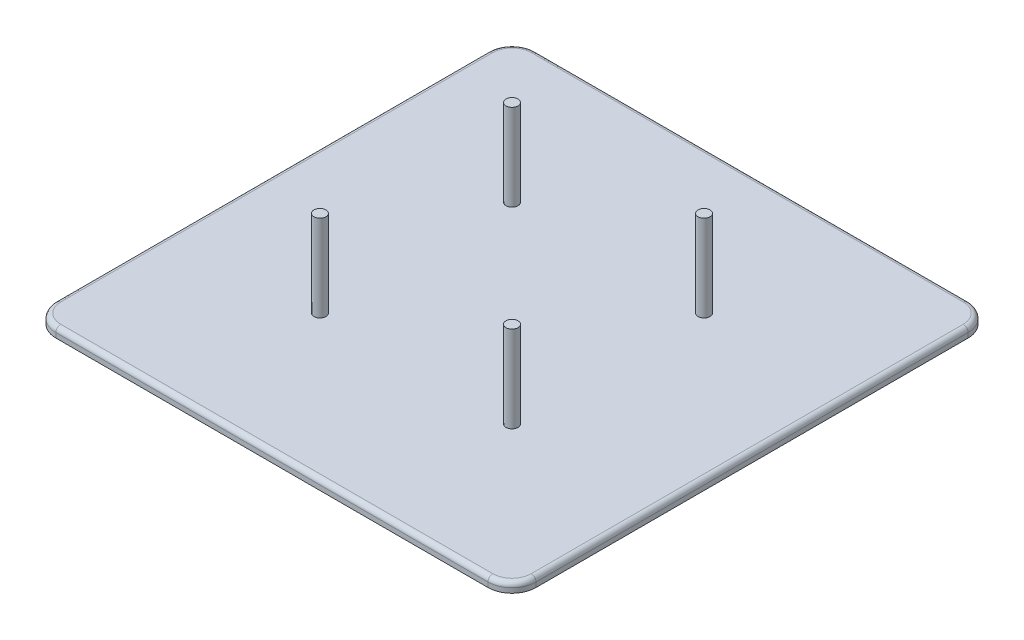
ISO-10303-21;
HEADER;
FILE_DESCRIPTION(('STEP AP214'),'2;1');
FILE_NAME('part.step','',(''),(''),'','','');
FILE_SCHEMA(('AUTOMOTIVE_DESIGN { 1 0 10303 214 1 1 1 1 }'));
ENDSEC;
DATA;
#1=APPLICATION_CONTEXT('core data for automotive mechanical design processes');
#2=APPLICATION_PROTOCOL_DEFINITION('international standard','automotive_design',2000,#1);
#3=PRODUCT_CONTEXT('',#1,'mechanical');
#4=PRODUCT('Part','Part','',(#3));
#5=PRODUCT_RELATED_PRODUCT_CATEGORY('part','',(#4));
#6=PRODUCT_DEFINITION_FORMATION('','',#4);
#7=PRODUCT_DEFINITION_CONTEXT('part definition',#1,'design');
#8=PRODUCT_DEFINITION('design','',#6,#7);
#9=PRODUCT_DEFINITION_SHAPE('','',#8);
#10=(LENGTH_UNIT() NAMED_UNIT(*) SI_UNIT(.MILLI.,.METRE.));
#11=(NAMED_UNIT(*) PLANE_ANGLE_UNIT() SI_UNIT($,.RADIAN.));
#12=(NAMED_UNIT(*) SI_UNIT($,.STERADIAN.) SOLID_ANGLE_UNIT());
#13=UNCERTAINTY_MEASURE_WITH_UNIT(LENGTH_MEASURE(1.E-05),#10,'distance_accuracy_value','');
#14=(GEOMETRIC_REPRESENTATION_CONTEXT(3) GLOBAL_UNCERTAINTY_ASSIGNED_CONTEXT((#13)) GLOBAL_UNIT_ASSIGNED_CONTEXT((#10,
#11,#12)) REPRESENTATION_CONTEXT('',''));
#15=CARTESIAN_POINT('',(0.,0.,0.));
#16=DIRECTION('',(0.,0.,1.));
#17=DIRECTION('',(1.,0.,0.));
#18=AXIS2_PLACEMENT_3D('',#15,#16,#17);
#19=CARTESIAN_POINT('',(0.,2.,0.));
#20=DIRECTION('',(0.,1.,0.));
#21=DIRECTION('',(0.,0.,1.));
#22=AXIS2_PLACEMENT_3D('',#19,#20,#21);
#23=PLANE('',#22);
#24=CARTESIAN_POINT('',(20.,2.,20.));
#25=DIRECTION('',(0.,1.,0.));
#26=DIRECTION('',(0.,0.,1.));
#27=AXIS2_PLACEMENT_3D('',#24,#25,#26);
#28=CIRCLE('',#27,1.25);
#29=CARTESIAN_POINT('',(20.,2.,21.25));
#30=VERTEX_POINT('',#29);
#31=EDGE_CURVE('E298',#30,#30,#28,.F.);
#32=ORIENTED_EDGE('',*,*,#31,.T.);
#33=EDGE_LOOP('',(#32));
#34=FACE_BOUND('',#33,.T.);
#35=CARTESIAN_POINT('',(20.,2.,-20.));
#36=DIRECTION('',(0.,1.,0.));
#37=DIRECTION('',(0.,0.,1.));
#38=AXIS2_PLACEMENT_3D('',#35,#36,#37);
#39=CIRCLE('',#38,1.25);
#40=CARTESIAN_POINT('',(20.,2.,-18.75));
#41=VERTEX_POINT('',#40);
#42=EDGE_CURVE('E292',#41,#41,#39,.F.);
#43=ORIENTED_EDGE('',*,*,#42,.T.);
#44=EDGE_LOOP('',(#43));
#45=FACE_BOUND('',#44,.T.);
#46=CARTESIAN_POINT('',(-20.,2.,-20.));
#47=DIRECTION('',(0.,1.,0.));
#48=DIRECTION('',(0.,0.,1.));
#49=AXIS2_PLACEMENT_3D('',#46,#47,#48);
#50=CIRCLE('',#49,1.25);
#51=CARTESIAN_POINT('',(-20.,2.,-18.75));
#52=VERTEX_POINT('',#51);
#53=EDGE_CURVE('E286',#52,#52,#50,.F.);
#54=ORIENTED_EDGE('',*,*,#53,.T.);
#55=EDGE_LOOP('',(#54));
#56=FACE_BOUND('',#55,.T.);
#57=CARTESIAN_POINT('',(-20.,2.,20.));
#58=DIRECTION('',(0.,1.,0.));
#59=DIRECTION('',(0.,0.,1.));
#60=AXIS2_PLACEMENT_3D('',#57,#58,#59);
#61=CIRCLE('',#60,1.25);
#62=CARTESIAN_POINT('',(-20.,2.,21.25));
#63=VERTEX_POINT('',#62);
#64=EDGE_CURVE('E279',#63,#63,#61,.F.);
#65=ORIENTED_EDGE('',*,*,#64,.T.);
#66=EDGE_LOOP('',(#65));
#67=FACE_BOUND('',#66,.T.);
#68=CARTESIAN_POINT('',(-45.,2.,45.));
#69=DIRECTION('',(0.,1.,0.));
#70=DIRECTION('',(0.,0.,1.));
#71=AXIS2_PLACEMENT_3D('',#68,#69,#70);
#72=CIRCLE('',#71,4.);
#73=CARTESIAN_POINT('',(-45.,2.,49.));
#74=VERTEX_POINT('',#73);
#75=CARTESIAN_POINT('',(-49.,2.,45.));
#76=VERTEX_POINT('',#75);
#77=EDGE_CURVE('E161',#74,#76,#72,.F.);
#78=ORIENTED_EDGE('',*,*,#77,.F.);
#79=DIRECTION('',(1.,0.,0.));
#80=VECTOR('',#79,1.);
#81=CARTESIAN_POINT('',(50.,2.,49.));
#82=LINE('',#81,#80);
#83=CARTESIAN_POINT('',(45.,2.,49.));
#84=VERTEX_POINT('',#83);
#85=EDGE_CURVE('E223',#74,#84,#82,.T.);
#86=ORIENTED_EDGE('',*,*,#85,.T.);
#87=CARTESIAN_POINT('',(45.,2.,45.));
#88=DIRECTION('',(0.,1.,0.));
#89=DIRECTION('',(0.,0.,1.));
#90=AXIS2_PLACEMENT_3D('',#87,#88,#89);
#91=CIRCLE('',#90,4.);
#92=CARTESIAN_POINT('',(49.,2.,45.));
#93=VERTEX_POINT('',#92);
#94=EDGE_CURVE('E172',#93,#84,#91,.F.);
#95=ORIENTED_EDGE('',*,*,#94,.F.);
#96=DIRECTION('',(0.,0.,-1.));
#97=VECTOR('',#96,1.);
#98=CARTESIAN_POINT('',(49.,2.,-50.));
#99=LINE('',#98,#97);
#100=CARTESIAN_POINT('',(49.,2.,-45.));
#101=VERTEX_POINT('',#100);
#102=EDGE_CURVE('E236',#93,#101,#99,.T.);
#103=ORIENTED_EDGE('',*,*,#102,.T.);
#104=CARTESIAN_POINT('',(45.,2.,-45.));
#105=DIRECTION('',(0.,1.,0.));
#106=DIRECTION('',(0.,0.,1.));
#107=AXIS2_PLACEMENT_3D('',#104,#105,#106);
#108=CIRCLE('',#107,4.);
#109=CARTESIAN_POINT('',(45.,2.,-49.));
#110=VERTEX_POINT('',#109);
#111=EDGE_CURVE('E165',#110,#101,#108,.F.);
#112=ORIENTED_EDGE('',*,*,#111,.F.);
#113=DIRECTION('',(-1.,0.,0.));
#114=VECTOR('',#113,1.);
#115=CARTESIAN_POINT('',(-50.,2.,-49.));
#116=LINE('',#115,#114);
#117=CARTESIAN_POINT('',(-45.,2.,-49.));
#118=VERTEX_POINT('',#117);
#119=EDGE_CURVE('E233',#110,#118,#116,.T.);
#120=ORIENTED_EDGE('',*,*,#119,.T.);
#121=CARTESIAN_POINT('',(-45.,2.,-45.));
#122=DIRECTION('',(0.,1.,0.));
#123=DIRECTION('',(0.,0.,1.));
#124=AXIS2_PLACEMENT_3D('',#121,#122,#123);
#125=CIRCLE('',#124,4.);
#126=CARTESIAN_POINT('',(-49.,2.,-45.));
#127=VERTEX_POINT('',#126);
#128=EDGE_CURVE('E162',#127,#118,#125,.F.);
#129=ORIENTED_EDGE('',*,*,#128,.F.);
#130=DIRECTION('',(0.,0.,1.));
#131=VECTOR('',#130,1.);
#132=CARTESIAN_POINT('',(-49.,2.,50.));
#133=LINE('',#132,#131);
#134=EDGE_CURVE('E231',#127,#76,#133,.T.);
#135=ORIENTED_EDGE('',*,*,#134,.T.);
#136=EDGE_LOOP('',(#78,#86,#95,#103,#112,#120,#129,#135));
#137=FACE_BOUND('',#136,.T.);
#138=ADVANCED_FACE('F35',(#34,#45,#56,#67,#137),#23,.T.);
#139=CARTESIAN_POINT('',(50.,2.,-50.));
#140=DIRECTION('',(-1.,0.,0.));
#141=DIRECTION('',(0.,0.,1.));
#142=AXIS2_PLACEMENT_3D('',#139,#140,#141);
#143=PLANE('',#142);
#144=DIRECTION('',(0.,0.,-1.));
#145=VECTOR('',#144,1.);
#146=CARTESIAN_POINT('',(50.,0.,-50.));
#147=LINE('',#146,#145);
#148=CARTESIAN_POINT('',(50.,0.,45.));
#149=VERTEX_POINT('',#148);
#150=CARTESIAN_POINT('',(50.,0.,-45.));
#151=VERTEX_POINT('',#150);
#152=EDGE_CURVE('E225',#149,#151,#147,.T.);
#153=ORIENTED_EDGE('',*,*,#152,.T.);
#154=DIRECTION('',(0.,-1.,0.));
#155=VECTOR('',#154,1.);
#156=CARTESIAN_POINT('',(50.,2.,-45.));
#157=LINE('',#156,#155);
#158=CARTESIAN_POINT('',(50.,1.,-45.));
#159=VERTEX_POINT('',#158);
#160=EDGE_CURVE('E200',#151,#159,#157,.F.);
#161=ORIENTED_EDGE('',*,*,#160,.T.);
#162=DIRECTION('',(0.,0.,-1.));
#163=VECTOR('',#162,1.);
#164=CARTESIAN_POINT('',(50.,1.,50.));
#165=LINE('',#164,#163);
#166=CARTESIAN_POINT('',(50.,1.,45.));
#167=VERTEX_POINT('',#166);
#168=EDGE_CURVE('E239',#159,#167,#165,.F.);
#169=ORIENTED_EDGE('',*,*,#168,.T.);
#170=DIRECTION('',(0.,-1.,0.));
#171=VECTOR('',#170,1.);
#172=CARTESIAN_POINT('',(50.,2.,45.));
#173=LINE('',#172,#171);
#174=EDGE_CURVE('E198',#167,#149,#173,.T.);
#175=ORIENTED_EDGE('',*,*,#174,.T.);
#176=EDGE_LOOP('',(#153,#161,#169,#175));
#177=FACE_BOUND('',#176,.T.);
#178=ADVANCED_FACE('F278',(#177),#143,.F.);
#179=CARTESIAN_POINT('',(-50.,2.,-50.));
#180=DIRECTION('',(0.,0.,1.));
#181=DIRECTION('',(1.,0.,0.));
#182=AXIS2_PLACEMENT_3D('',#179,#180,#181);
#183=PLANE('',#182);
#184=DIRECTION('',(-1.,0.,0.));
#185=VECTOR('',#184,1.);
#186=CARTESIAN_POINT('',(-50.,0.,-50.));
#187=LINE('',#186,#185);
#188=CARTESIAN_POINT('',(45.,0.,-50.));
#189=VERTEX_POINT('',#188);
#190=CARTESIAN_POINT('',(-45.,0.,-50.));
#191=VERTEX_POINT('',#190);
#192=EDGE_CURVE('E220',#189,#191,#187,.T.);
#193=ORIENTED_EDGE('',*,*,#192,.T.);
#194=DIRECTION('',(0.,-1.,0.));
#195=VECTOR('',#194,1.);
#196=CARTESIAN_POINT('',(-45.,2.,-50.));
#197=LINE('',#196,#195);
#198=CARTESIAN_POINT('',(-45.,1.,-50.));
#199=VERTEX_POINT('',#198);
#200=EDGE_CURVE('E196',#191,#199,#197,.F.);
#201=ORIENTED_EDGE('',*,*,#200,.T.);
#202=DIRECTION('',(-1.,0.,0.));
#203=VECTOR('',#202,1.);
#204=CARTESIAN_POINT('',(50.,1.,-50.));
#205=LINE('',#204,#203);
#206=CARTESIAN_POINT('',(45.,1.,-50.));
#207=VERTEX_POINT('',#206);
#208=EDGE_CURVE('E149',#199,#207,#205,.F.);
#209=ORIENTED_EDGE('',*,*,#208,.T.);
#210=DIRECTION('',(0.,-1.,0.));
#211=VECTOR('',#210,1.);
#212=CARTESIAN_POINT('',(45.,2.,-50.));
#213=LINE('',#212,#211);
#214=EDGE_CURVE('E59',#207,#189,#213,.T.);
#215=ORIENTED_EDGE('',*,*,#214,.T.);
#216=EDGE_LOOP('',(#193,#201,#209,#215));
#217=FACE_BOUND('',#216,.T.);
#218=ADVANCED_FACE('F270',(#217),#183,.F.);
#219=CARTESIAN_POINT('',(-50.,2.,-50.));
#220=DIRECTION('',(1.,0.,0.));
#221=DIRECTION('',(0.,0.,-1.));
#222=AXIS2_PLACEMENT_3D('',#219,#220,#221);
#223=PLANE('',#222);
#224=DIRECTION('',(0.,0.,1.));
#225=VECTOR('',#224,1.);
#226=CARTESIAN_POINT('',(-50.,1.,-50.));
#227=LINE('',#226,#225);
#228=CARTESIAN_POINT('',(-50.,1.,45.));
#229=VERTEX_POINT('',#228);
#230=CARTESIAN_POINT('',(-50.,1.,-45.));
#231=VERTEX_POINT('',#230);
#232=EDGE_CURVE('E131',#229,#231,#227,.F.);
#233=ORIENTED_EDGE('',*,*,#232,.T.);
#234=DIRECTION('',(0.,-1.,0.));
#235=VECTOR('',#234,1.);
#236=CARTESIAN_POINT('',(-50.,2.,-45.));
#237=LINE('',#236,#235);
#238=CARTESIAN_POINT('',(-50.,0.,-45.));
#239=VERTEX_POINT('',#238);
#240=EDGE_CURVE('E137',#231,#239,#237,.T.);
#241=ORIENTED_EDGE('',*,*,#240,.T.);
#242=DIRECTION('',(0.,0.,1.));
#243=VECTOR('',#242,1.);
#244=CARTESIAN_POINT('',(-50.,0.,-50.));
#245=LINE('',#244,#243);
#246=CARTESIAN_POINT('',(-50.,0.,45.));
#247=VERTEX_POINT('',#246);
#248=EDGE_CURVE('E133',#239,#247,#245,.T.);
#249=ORIENTED_EDGE('',*,*,#248,.T.);
#250=DIRECTION('',(0.,-1.,0.));
#251=VECTOR('',#250,1.);
#252=CARTESIAN_POINT('',(-50.,2.,45.));
#253=LINE('',#252,#251);
#254=EDGE_CURVE('E128',#247,#229,#253,.F.);
#255=ORIENTED_EDGE('',*,*,#254,.T.);
#256=EDGE_LOOP('',(#233,#241,#249,#255));
#257=FACE_BOUND('',#256,.T.);
#258=ADVANCED_FACE('F130',(#257),#223,.F.);
#259=CARTESIAN_POINT('',(-50.,2.,50.));
#260=DIRECTION('',(0.,0.,-1.));
#261=DIRECTION('',(-1.,0.,0.));
#262=AXIS2_PLACEMENT_3D('',#259,#260,#261);
#263=PLANE('',#262);
#264=DIRECTION('',(1.,0.,0.));
#265=VECTOR('',#264,1.);
#266=CARTESIAN_POINT('',(-50.,0.,50.));
#267=LINE('',#266,#265);
#268=CARTESIAN_POINT('',(-45.,0.,50.));
#269=VERTEX_POINT('',#268);
#270=CARTESIAN_POINT('',(45.,0.,50.));
#271=VERTEX_POINT('',#270);
#272=EDGE_CURVE('E219',#269,#271,#267,.T.);
#273=ORIENTED_EDGE('',*,*,#272,.T.);
#274=DIRECTION('',(0.,-1.,0.));
#275=VECTOR('',#274,1.);
#276=CARTESIAN_POINT('',(45.,2.,50.));
#277=LINE('',#276,#275);
#278=CARTESIAN_POINT('',(45.,1.,50.));
#279=VERTEX_POINT('',#278);
#280=EDGE_CURVE('E11',#271,#279,#277,.F.);
#281=ORIENTED_EDGE('',*,*,#280,.T.);
#282=DIRECTION('',(1.,0.,0.));
#283=VECTOR('',#282,1.);
#284=CARTESIAN_POINT('',(-50.,1.,50.));
#285=LINE('',#284,#283);
#286=CARTESIAN_POINT('',(-45.,1.,50.));
#287=VERTEX_POINT('',#286);
#288=EDGE_CURVE('E148',#279,#287,#285,.F.);
#289=ORIENTED_EDGE('',*,*,#288,.T.);
#290=DIRECTION('',(0.,-1.,0.));
#291=VECTOR('',#290,1.);
#292=CARTESIAN_POINT('',(-45.,2.,50.));
#293=LINE('',#292,#291);
#294=EDGE_CURVE('E44',#287,#269,#293,.T.);
#295=ORIENTED_EDGE('',*,*,#294,.T.);
#296=EDGE_LOOP('',(#273,#281,#289,#295));
#297=FACE_BOUND('',#296,.T.);
#298=ADVANCED_FACE('F245',(#297),#263,.F.);
#299=CARTESIAN_POINT('',(0.,0.,0.));
#300=DIRECTION('',(0.,1.,0.));
#301=DIRECTION('',(0.,0.,1.));
#302=AXIS2_PLACEMENT_3D('',#299,#300,#301);
#303=PLANE('',#302);
#304=ORIENTED_EDGE('',*,*,#248,.F.);
#305=CARTESIAN_POINT('',(-45.,0.,-45.));
#306=DIRECTION('',(0.,1.,0.));
#307=DIRECTION('',(0.,0.,1.));
#308=AXIS2_PLACEMENT_3D('',#305,#306,#307);
#309=CIRCLE('',#308,5.);
#310=EDGE_CURVE('E52',#239,#191,#309,.F.);
#311=ORIENTED_EDGE('',*,*,#310,.T.);
#312=ORIENTED_EDGE('',*,*,#192,.F.);
#313=CARTESIAN_POINT('',(45.,0.,-45.));
#314=DIRECTION('',(0.,1.,0.));
#315=DIRECTION('',(0.,0.,1.));
#316=AXIS2_PLACEMENT_3D('',#313,#314,#315);
#317=CIRCLE('',#316,5.);
#318=EDGE_CURVE('E192',#189,#151,#317,.F.);
#319=ORIENTED_EDGE('',*,*,#318,.T.);
#320=ORIENTED_EDGE('',*,*,#152,.F.);
#321=CARTESIAN_POINT('',(45.,0.,45.));
#322=DIRECTION('',(0.,1.,0.));
#323=DIRECTION('',(0.,0.,1.));
#324=AXIS2_PLACEMENT_3D('',#321,#322,#323);
#325=CIRCLE('',#324,5.);
#326=EDGE_CURVE('E190',#149,#271,#325,.F.);
#327=ORIENTED_EDGE('',*,*,#326,.T.);
#328=ORIENTED_EDGE('',*,*,#272,.F.);
#329=CARTESIAN_POINT('',(-45.,0.,45.));
#330=DIRECTION('',(0.,1.,0.));
#331=DIRECTION('',(0.,0.,1.));
#332=AXIS2_PLACEMENT_3D('',#329,#330,#331);
#333=CIRCLE('',#332,5.);
#334=EDGE_CURVE('E188',#269,#247,#333,.F.);
#335=ORIENTED_EDGE('',*,*,#334,.T.);
#336=EDGE_LOOP('',(#304,#311,#312,#319,#320,#327,#328,#335));
#337=FACE_BOUND('',#336,.T.);
#338=ADVANCED_FACE('F217',(#337),#303,.F.);
#339=CARTESIAN_POINT('',(-20.,20.,20.));
#340=DIRECTION('',(0.,-1.,0.));
#341=DIRECTION('',(0.,0.,-1.));
#342=AXIS2_PLACEMENT_3D('',#339,#340,#341);
#343=CYLINDRICAL_SURFACE('',#342,1.25);
#344=ORIENTED_EDGE('',*,*,#64,.F.);
#345=EDGE_LOOP('',(#344));
#346=FACE_BOUND('',#345,.T.);
#347=CARTESIAN_POINT('',(-20.,20.,20.));
#348=DIRECTION('',(0.,1.,0.));
#349=DIRECTION('',(0.,0.,1.));
#350=AXIS2_PLACEMENT_3D('',#347,#348,#349);
#351=CIRCLE('',#350,1.25);
#352=CARTESIAN_POINT('',(-20.,20.,21.25));
#353=VERTEX_POINT('',#352);
#354=EDGE_CURVE('E281',#353,#353,#351,.T.);
#355=ORIENTED_EDGE('',*,*,#354,.F.);
#356=EDGE_LOOP('',(#355));
#357=FACE_BOUND('',#356,.T.);
#358=ADVANCED_FACE('F330',(#346,#357),#343,.T.);
#359=CARTESIAN_POINT('',(-20.,20.,20.));
#360=DIRECTION('',(0.,1.,0.));
#361=DIRECTION('',(0.,0.,1.));
#362=AXIS2_PLACEMENT_3D('',#359,#360,#361);
#363=PLANE('',#362);
#364=ORIENTED_EDGE('',*,*,#354,.T.);
#365=EDGE_LOOP('',(#364));
#366=FACE_BOUND('',#365,.T.);
#367=ADVANCED_FACE('F455',(#366),#363,.T.);
#368=CARTESIAN_POINT('',(-20.,20.,-20.));
#369=DIRECTION('',(0.,-1.,0.));
#370=DIRECTION('',(0.,0.,-1.));
#371=AXIS2_PLACEMENT_3D('',#368,#369,#370);
#372=CYLINDRICAL_SURFACE('',#371,1.25);
#373=ORIENTED_EDGE('',*,*,#53,.F.);
#374=EDGE_LOOP('',(#373));
#375=FACE_BOUND('',#374,.T.);
#376=CARTESIAN_POINT('',(-20.,20.,-20.));
#377=DIRECTION('',(0.,1.,0.));
#378=DIRECTION('',(0.,0.,1.));
#379=AXIS2_PLACEMENT_3D('',#376,#377,#378);
#380=CIRCLE('',#379,1.25);
#381=CARTESIAN_POINT('',(-20.,20.,-18.75));
#382=VERTEX_POINT('',#381);
#383=EDGE_CURVE('E289',#382,#382,#380,.T.);
#384=ORIENTED_EDGE('',*,*,#383,.F.);
#385=EDGE_LOOP('',(#384));
#386=FACE_BOUND('',#385,.T.);
#387=ADVANCED_FACE('F461',(#375,#386),#372,.T.);
#388=CARTESIAN_POINT('',(-20.,20.,-20.));
#389=DIRECTION('',(0.,1.,0.));
#390=DIRECTION('',(0.,0.,1.));
#391=AXIS2_PLACEMENT_3D('',#388,#389,#390);
#392=PLANE('',#391);
#393=ORIENTED_EDGE('',*,*,#383,.T.);
#394=EDGE_LOOP('',(#393));
#395=FACE_BOUND('',#394,.T.);
#396=ADVANCED_FACE('F468',(#395),#392,.T.);
#397=CARTESIAN_POINT('',(20.,20.,-20.));
#398=DIRECTION('',(0.,-1.,0.));
#399=DIRECTION('',(0.,0.,-1.));
#400=AXIS2_PLACEMENT_3D('',#397,#398,#399);
#401=CYLINDRICAL_SURFACE('',#400,1.25);
#402=ORIENTED_EDGE('',*,*,#42,.F.);
#403=EDGE_LOOP('',(#402));
#404=FACE_BOUND('',#403,.T.);
#405=CARTESIAN_POINT('',(20.,20.,-20.));
#406=DIRECTION('',(0.,1.,0.));
#407=DIRECTION('',(0.,0.,1.));
#408=AXIS2_PLACEMENT_3D('',#405,#406,#407);
#409=CIRCLE('',#408,1.25);
#410=CARTESIAN_POINT('',(20.,20.,-18.75));
#411=VERTEX_POINT('',#410);
#412=EDGE_CURVE('E295',#411,#411,#409,.T.);
#413=ORIENTED_EDGE('',*,*,#412,.F.);
#414=EDGE_LOOP('',(#413));
#415=FACE_BOUND('',#414,.T.);
#416=ADVANCED_FACE('F316',(#404,#415),#401,.T.);
#417=CARTESIAN_POINT('',(20.,20.,-20.));
#418=DIRECTION('',(0.,1.,0.));
#419=DIRECTION('',(0.,0.,1.));
#420=AXIS2_PLACEMENT_3D('',#417,#418,#419);
#421=PLANE('',#420);
#422=ORIENTED_EDGE('',*,*,#412,.T.);
#423=EDGE_LOOP('',(#422));
#424=FACE_BOUND('',#423,.T.);
#425=ADVANCED_FACE('F308',(#424),#421,.T.);
#426=CARTESIAN_POINT('',(20.,20.,20.));
#427=DIRECTION('',(0.,-1.,0.));
#428=DIRECTION('',(0.,0.,-1.));
#429=AXIS2_PLACEMENT_3D('',#426,#427,#428);
#430=CYLINDRICAL_SURFACE('',#429,1.25);
#431=ORIENTED_EDGE('',*,*,#31,.F.);
#432=EDGE_LOOP('',(#431));
#433=FACE_BOUND('',#432,.T.);
#434=CARTESIAN_POINT('',(20.,20.,20.));
#435=DIRECTION('',(0.,1.,0.));
#436=DIRECTION('',(0.,0.,1.));
#437=AXIS2_PLACEMENT_3D('',#434,#435,#436);
#438=CIRCLE('',#437,1.25);
#439=CARTESIAN_POINT('',(20.,20.,21.25));
#440=VERTEX_POINT('',#439);
#441=EDGE_CURVE('E157',#440,#440,#438,.T.);
#442=ORIENTED_EDGE('',*,*,#441,.F.);
#443=EDGE_LOOP('',(#442));
#444=FACE_BOUND('',#443,.T.);
#445=ADVANCED_FACE('F306',(#433,#444),#430,.T.);
#446=CARTESIAN_POINT('',(20.,20.,20.));
#447=DIRECTION('',(0.,1.,0.));
#448=DIRECTION('',(0.,0.,1.));
#449=AXIS2_PLACEMENT_3D('',#446,#447,#448);
#450=PLANE('',#449);
#451=ORIENTED_EDGE('',*,*,#441,.T.);
#452=EDGE_LOOP('',(#451));
#453=FACE_BOUND('',#452,.T.);
#454=ADVANCED_FACE('F304',(#453),#450,.T.);
#455=CARTESIAN_POINT('',(-49.,1.,0.));
#456=DIRECTION('',(0.,0.,-1.));
#457=DIRECTION('',(-1.,0.,0.));
#458=AXIS2_PLACEMENT_3D('',#455,#456,#457);
#459=CYLINDRICAL_SURFACE('',#458,1.);
#460=ORIENTED_EDGE('',*,*,#232,.F.);
#461=CARTESIAN_POINT('',(-49.,1.,45.));
#462=DIRECTION('',(0.,0.,-1.));
#463=DIRECTION('',(-1.,0.,0.));
#464=AXIS2_PLACEMENT_3D('',#461,#462,#463);
#465=CIRCLE('',#464,1.);
#466=EDGE_CURVE('E145',#229,#76,#465,.T.);
#467=ORIENTED_EDGE('',*,*,#466,.T.);
#468=ORIENTED_EDGE('',*,*,#134,.F.);
#469=CARTESIAN_POINT('',(-49.,1.,-45.));
#470=DIRECTION('',(0.,0.,1.));
#471=DIRECTION('',(1.,0.,0.));
#472=AXIS2_PLACEMENT_3D('',#469,#470,#471);
#473=CIRCLE('',#472,1.);
#474=EDGE_CURVE('E147',#127,#231,#473,.T.);
#475=ORIENTED_EDGE('',*,*,#474,.T.);
#476=EDGE_LOOP('',(#460,#467,#468,#475));
#477=FACE_BOUND('',#476,.T.);
#478=ADVANCED_FACE('F142',(#477),#459,.T.);
#479=CARTESIAN_POINT('',(0.,1.,49.));
#480=DIRECTION('',(-1.,0.,0.));
#481=DIRECTION('',(0.,0.,1.));
#482=AXIS2_PLACEMENT_3D('',#479,#480,#481);
#483=CYLINDRICAL_SURFACE('',#482,1.);
#484=ORIENTED_EDGE('',*,*,#288,.F.);
#485=CARTESIAN_POINT('',(45.,1.,49.));
#486=DIRECTION('',(-1.,0.,0.));
#487=DIRECTION('',(0.,0.,1.));
#488=AXIS2_PLACEMENT_3D('',#485,#486,#487);
#489=CIRCLE('',#488,1.);
#490=EDGE_CURVE('E177',#279,#84,#489,.T.);
#491=ORIENTED_EDGE('',*,*,#490,.T.);
#492=ORIENTED_EDGE('',*,*,#85,.F.);
#493=CARTESIAN_POINT('',(-45.,1.,49.));
#494=DIRECTION('',(1.,0.,0.));
#495=DIRECTION('',(0.,0.,-1.));
#496=AXIS2_PLACEMENT_3D('',#493,#494,#495);
#497=CIRCLE('',#496,1.);
#498=EDGE_CURVE('E175',#74,#287,#497,.T.);
#499=ORIENTED_EDGE('',*,*,#498,.T.);
#500=EDGE_LOOP('',(#484,#491,#492,#499));
#501=FACE_BOUND('',#500,.T.);
#502=ADVANCED_FACE('F249',(#501),#483,.T.);
#503=CARTESIAN_POINT('',(0.,1.,-49.));
#504=DIRECTION('',(1.,0.,0.));
#505=DIRECTION('',(0.,0.,-1.));
#506=AXIS2_PLACEMENT_3D('',#503,#504,#505);
#507=CYLINDRICAL_SURFACE('',#506,1.);
#508=ORIENTED_EDGE('',*,*,#208,.F.);
#509=CARTESIAN_POINT('',(-45.,1.,-49.));
#510=DIRECTION('',(1.,0.,0.));
#511=DIRECTION('',(0.,0.,-1.));
#512=AXIS2_PLACEMENT_3D('',#509,#510,#511);
#513=CIRCLE('',#512,1.);
#514=EDGE_CURVE('E138',#199,#118,#513,.T.);
#515=ORIENTED_EDGE('',*,*,#514,.T.);
#516=ORIENTED_EDGE('',*,*,#119,.F.);
#517=CARTESIAN_POINT('',(45.,1.,-49.));
#518=DIRECTION('',(-1.,0.,0.));
#519=DIRECTION('',(0.,0.,1.));
#520=AXIS2_PLACEMENT_3D('',#517,#518,#519);
#521=CIRCLE('',#520,1.);
#522=EDGE_CURVE('E184',#110,#207,#521,.T.);
#523=ORIENTED_EDGE('',*,*,#522,.T.);
#524=EDGE_LOOP('',(#508,#515,#516,#523));
#525=FACE_BOUND('',#524,.T.);
#526=ADVANCED_FACE('F269',(#525),#507,.T.);
#527=CARTESIAN_POINT('',(49.,1.,0.));
#528=DIRECTION('',(0.,0.,1.));
#529=DIRECTION('',(1.,0.,0.));
#530=AXIS2_PLACEMENT_3D('',#527,#528,#529);
#531=CYLINDRICAL_SURFACE('',#530,1.);
#532=ORIENTED_EDGE('',*,*,#168,.F.);
#533=CARTESIAN_POINT('',(49.,1.,-45.));
#534=DIRECTION('',(0.,0.,1.));
#535=DIRECTION('',(1.,0.,0.));
#536=AXIS2_PLACEMENT_3D('',#533,#534,#535);
#537=CIRCLE('',#536,1.);
#538=EDGE_CURVE('E182',#159,#101,#537,.T.);
#539=ORIENTED_EDGE('',*,*,#538,.T.);
#540=ORIENTED_EDGE('',*,*,#102,.F.);
#541=CARTESIAN_POINT('',(49.,1.,45.));
#542=DIRECTION('',(0.,0.,-1.));
#543=DIRECTION('',(-1.,0.,0.));
#544=AXIS2_PLACEMENT_3D('',#541,#542,#543);
#545=CIRCLE('',#544,1.);
#546=EDGE_CURVE('E180',#93,#167,#545,.T.);
#547=ORIENTED_EDGE('',*,*,#546,.T.);
#548=EDGE_LOOP('',(#532,#539,#540,#547));
#549=FACE_BOUND('',#548,.T.);
#550=ADVANCED_FACE('F264',(#549),#531,.T.);
#551=CARTESIAN_POINT('',(-45.,2.,45.));
#552=DIRECTION('',(0.,-1.,0.));
#553=DIRECTION('',(0.,0.,-1.));
#554=AXIS2_PLACEMENT_3D('',#551,#552,#553);
#555=CYLINDRICAL_SURFACE('',#554,5.);
#556=ORIENTED_EDGE('',*,*,#334,.F.);
#557=ORIENTED_EDGE('',*,*,#294,.F.);
#558=CARTESIAN_POINT('',(-45.,1.,45.));
#559=DIRECTION('',(0.,1.,0.));
#560=DIRECTION('',(0.,0.,1.));
#561=AXIS2_PLACEMENT_3D('',#558,#559,#560);
#562=CIRCLE('',#561,5.);
#563=EDGE_CURVE('E153',#229,#287,#562,.T.);
#564=ORIENTED_EDGE('',*,*,#563,.F.);
#565=ORIENTED_EDGE('',*,*,#254,.F.);
#566=EDGE_LOOP('',(#556,#557,#564,#565));
#567=FACE_BOUND('',#566,.T.);
#568=ADVANCED_FACE('F154',(#567),#555,.T.);
#569=CARTESIAN_POINT('',(-45.,1.,45.));
#570=DIRECTION('',(0.,1.,0.));
#571=DIRECTION('',(0.,0.,1.));
#572=AXIS2_PLACEMENT_3D('',#569,#570,#571);
#573=TOROIDAL_SURFACE('',#572,4.,1.);
#574=ORIENTED_EDGE('',*,*,#466,.F.);
#575=ORIENTED_EDGE('',*,*,#563,.T.);
#576=ORIENTED_EDGE('',*,*,#498,.F.);
#577=ORIENTED_EDGE('',*,*,#77,.T.);
#578=EDGE_LOOP('',(#574,#575,#576,#577));
#579=FACE_BOUND('',#578,.T.);
#580=ADVANCED_FACE('F160',(#579),#573,.T.);
#581=CARTESIAN_POINT('',(45.,2.,45.));
#582=DIRECTION('',(0.,-1.,0.));
#583=DIRECTION('',(0.,0.,-1.));
#584=AXIS2_PLACEMENT_3D('',#581,#582,#583);
#585=CYLINDRICAL_SURFACE('',#584,5.);
#586=ORIENTED_EDGE('',*,*,#326,.F.);
#587=ORIENTED_EDGE('',*,*,#174,.F.);
#588=CARTESIAN_POINT('',(45.,1.,45.));
#589=DIRECTION('',(0.,1.,0.));
#590=DIRECTION('',(0.,0.,1.));
#591=AXIS2_PLACEMENT_3D('',#588,#589,#590);
#592=CIRCLE('',#591,5.);
#593=EDGE_CURVE('E158',#279,#167,#592,.T.);
#594=ORIENTED_EDGE('',*,*,#593,.F.);
#595=ORIENTED_EDGE('',*,*,#280,.F.);
#596=EDGE_LOOP('',(#586,#587,#594,#595));
#597=FACE_BOUND('',#596,.T.);
#598=ADVANCED_FACE('F255',(#597),#585,.T.);
#599=CARTESIAN_POINT('',(45.,1.,45.));
#600=DIRECTION('',(0.,1.,0.));
#601=DIRECTION('',(0.,0.,1.));
#602=AXIS2_PLACEMENT_3D('',#599,#600,#601);
#603=TOROIDAL_SURFACE('',#602,4.,1.);
#604=ORIENTED_EDGE('',*,*,#490,.F.);
#605=ORIENTED_EDGE('',*,*,#593,.T.);
#606=ORIENTED_EDGE('',*,*,#546,.F.);
#607=ORIENTED_EDGE('',*,*,#94,.T.);
#608=EDGE_LOOP('',(#604,#605,#606,#607));
#609=FACE_BOUND('',#608,.T.);
#610=ADVANCED_FACE('F258',(#609),#603,.T.);
#611=CARTESIAN_POINT('',(45.,2.,-45.));
#612=DIRECTION('',(0.,-1.,0.));
#613=DIRECTION('',(0.,0.,-1.));
#614=AXIS2_PLACEMENT_3D('',#611,#612,#613);
#615=CYLINDRICAL_SURFACE('',#614,5.);
#616=ORIENTED_EDGE('',*,*,#318,.F.);
#617=ORIENTED_EDGE('',*,*,#214,.F.);
#618=CARTESIAN_POINT('',(45.,1.,-45.));
#619=DIRECTION('',(0.,1.,0.));
#620=DIRECTION('',(0.,0.,1.));
#621=AXIS2_PLACEMENT_3D('',#618,#619,#620);
#622=CIRCLE('',#621,5.);
#623=EDGE_CURVE('E204',#159,#207,#622,.T.);
#624=ORIENTED_EDGE('',*,*,#623,.F.);
#625=ORIENTED_EDGE('',*,*,#160,.F.);
#626=EDGE_LOOP('',(#616,#617,#624,#625));
#627=FACE_BOUND('',#626,.T.);
#628=ADVANCED_FACE('F273',(#627),#615,.T.);
#629=CARTESIAN_POINT('',(45.,1.,-45.));
#630=DIRECTION('',(0.,1.,0.));
#631=DIRECTION('',(0.,0.,1.));
#632=AXIS2_PLACEMENT_3D('',#629,#630,#631);
#633=TOROIDAL_SURFACE('',#632,4.,1.);
#634=ORIENTED_EDGE('',*,*,#522,.F.);
#635=ORIENTED_EDGE('',*,*,#111,.T.);
#636=ORIENTED_EDGE('',*,*,#538,.F.);
#637=ORIENTED_EDGE('',*,*,#623,.T.);
#638=EDGE_LOOP('',(#634,#635,#636,#637));
#639=FACE_BOUND('',#638,.T.);
#640=ADVANCED_FACE('F265',(#639),#633,.T.);
#641=CARTESIAN_POINT('',(-45.,2.,-45.));
#642=DIRECTION('',(0.,-1.,0.));
#643=DIRECTION('',(0.,0.,-1.));
#644=AXIS2_PLACEMENT_3D('',#641,#642,#643);
#645=CYLINDRICAL_SURFACE('',#644,5.);
#646=ORIENTED_EDGE('',*,*,#310,.F.);
#647=ORIENTED_EDGE('',*,*,#240,.F.);
#648=CARTESIAN_POINT('',(-45.,1.,-45.));
#649=DIRECTION('',(0.,1.,0.));
#650=DIRECTION('',(0.,0.,1.));
#651=AXIS2_PLACEMENT_3D('',#648,#649,#650);
#652=CIRCLE('',#651,5.);
#653=EDGE_CURVE('E39',#199,#231,#652,.T.);
#654=ORIENTED_EDGE('',*,*,#653,.F.);
#655=ORIENTED_EDGE('',*,*,#200,.F.);
#656=EDGE_LOOP('',(#646,#647,#654,#655));
#657=FACE_BOUND('',#656,.T.);
#658=ADVANCED_FACE('F37',(#657),#645,.T.);
#659=CARTESIAN_POINT('',(-45.,1.,-45.));
#660=DIRECTION('',(0.,1.,0.));
#661=DIRECTION('',(0.,0.,1.));
#662=AXIS2_PLACEMENT_3D('',#659,#660,#661);
#663=TOROIDAL_SURFACE('',#662,4.,1.);
#664=ORIENTED_EDGE('',*,*,#474,.F.);
#665=ORIENTED_EDGE('',*,*,#128,.T.);
#666=ORIENTED_EDGE('',*,*,#514,.F.);
#667=ORIENTED_EDGE('',*,*,#653,.T.);
#668=EDGE_LOOP('',(#664,#665,#666,#667));
#669=FACE_BOUND('',#668,.T.);
#670=ADVANCED_FACE('F213',(#669),#663,.T.);
#671=CLOSED_SHELL('',(#138,#178,#218,#258,#298,#338,#358,#367,#387,#396,#416,#425,#445,#454,
#478,#502,#526,#550,#568,#580,#598,#610,#628,#640,#658,#670));
#672=MANIFOLD_SOLID_BREP('B2',#671);
#673=ADVANCED_BREP_SHAPE_REPRESENTATION('',(#18,#672),#14);
#674=SHAPE_DEFINITION_REPRESENTATION(#9,#673);
ENDSEC;
END-ISO-10303-21;
